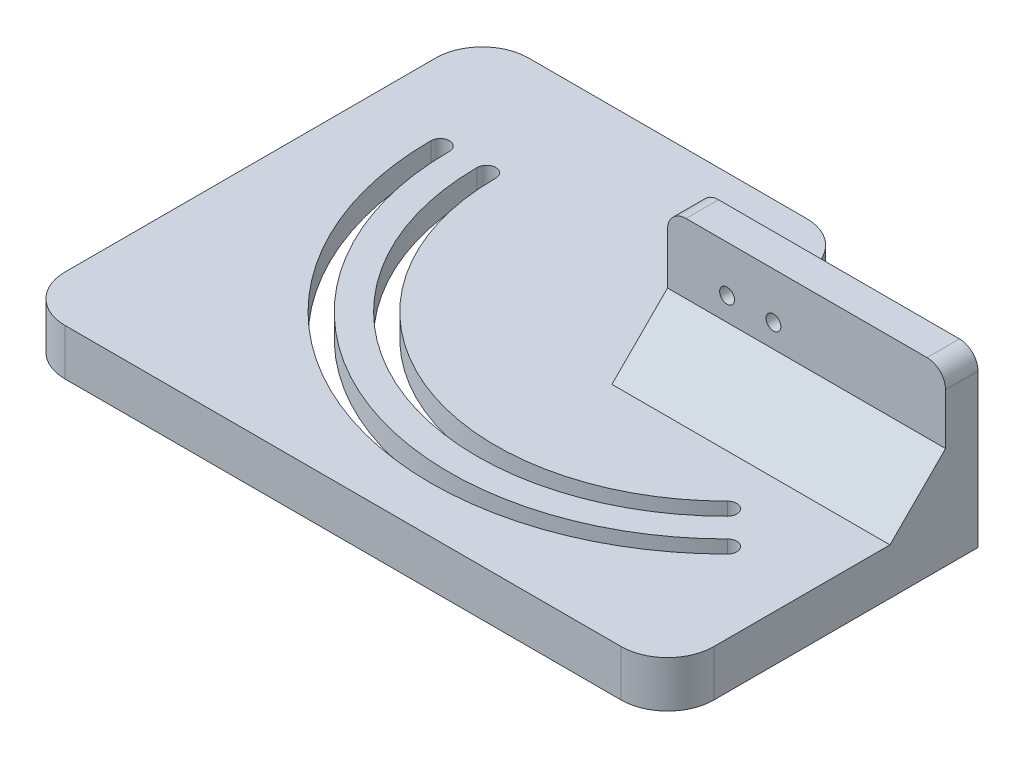
ISO-10303-21;
HEADER;
FILE_DESCRIPTION(('STEP AP214'),'2;1');
FILE_NAME('part.step','',(''),(''),'','','');
FILE_SCHEMA(('AUTOMOTIVE_DESIGN { 1 0 10303 214 1 1 1 1 }'));
ENDSEC;
DATA;
#1=APPLICATION_CONTEXT('core data for automotive mechanical design processes');
#2=APPLICATION_PROTOCOL_DEFINITION('international standard','automotive_design',2000,#1);
#3=PRODUCT_CONTEXT('',#1,'mechanical');
#4=PRODUCT('Part','Part','',(#3));
#5=PRODUCT_RELATED_PRODUCT_CATEGORY('part','',(#4));
#6=PRODUCT_DEFINITION_FORMATION('','',#4);
#7=PRODUCT_DEFINITION_CONTEXT('part definition',#1,'design');
#8=PRODUCT_DEFINITION('design','',#6,#7);
#9=PRODUCT_DEFINITION_SHAPE('','',#8);
#10=(LENGTH_UNIT() NAMED_UNIT(*) SI_UNIT(.MILLI.,.METRE.));
#11=(NAMED_UNIT(*) PLANE_ANGLE_UNIT() SI_UNIT($,.RADIAN.));
#12=(NAMED_UNIT(*) SI_UNIT($,.STERADIAN.) SOLID_ANGLE_UNIT());
#13=UNCERTAINTY_MEASURE_WITH_UNIT(LENGTH_MEASURE(1.E-05),#10,'distance_accuracy_value','');
#14=(GEOMETRIC_REPRESENTATION_CONTEXT(3) GLOBAL_UNCERTAINTY_ASSIGNED_CONTEXT((#13)) GLOBAL_UNIT_ASSIGNED_CONTEXT((#10,
#11,#12)) REPRESENTATION_CONTEXT('',''));
#15=CARTESIAN_POINT('',(0.,0.,0.));
#16=DIRECTION('',(0.,0.,1.));
#17=DIRECTION('',(1.,0.,0.));
#18=AXIS2_PLACEMENT_3D('',#15,#16,#17);
#19=CARTESIAN_POINT('',(0.,0.,0.));
#20=DIRECTION('',(0.,-1.,0.));
#21=DIRECTION('',(0.,0.,-1.));
#22=AXIS2_PLACEMENT_3D('',#19,#20,#21);
#23=PLANE('',#22);
#24=DIRECTION('',(-1.,0.,0.));
#25=VECTOR('',#24,1.);
#26=CARTESIAN_POINT('',(0.,0.,-120.));
#27=LINE('',#26,#25);
#28=CARTESIAN_POINT('',(100.,0.,-120.));
#29=VERTEX_POINT('',#28);
#30=CARTESIAN_POINT('',(40.,0.,-120.));
#31=VERTEX_POINT('',#30);
#32=EDGE_CURVE('E315',#29,#31,#27,.T.);
#33=ORIENTED_EDGE('',*,*,#32,.F.);
#34=CARTESIAN_POINT('',(100.,0.,-110.));
#35=DIRECTION('',(0.,-1.,0.));
#36=DIRECTION('',(0.,0.,-1.));
#37=AXIS2_PLACEMENT_3D('',#34,#35,#36);
#38=CIRCLE('',#37,10.);
#39=CARTESIAN_POINT('',(110.,0.,-110.));
#40=VERTEX_POINT('',#39);
#41=EDGE_CURVE('E85',#29,#40,#38,.T.);
#42=ORIENTED_EDGE('',*,*,#41,.T.);
#43=DIRECTION('',(0.,0.,-1.));
#44=VECTOR('',#43,1.);
#45=CARTESIAN_POINT('',(110.,0.,0.));
#46=LINE('',#45,#44);
#47=CARTESIAN_POINT('',(110.,0.,-97.));
#48=VERTEX_POINT('',#47);
#49=EDGE_CURVE('E428',#48,#40,#46,.T.);
#50=ORIENTED_EDGE('',*,*,#49,.F.);
#51=CARTESIAN_POINT('',(120.,0.,-97.));
#52=DIRECTION('',(0.,-1.,0.));
#53=DIRECTION('',(0.,0.,-1.));
#54=AXIS2_PLACEMENT_3D('',#51,#52,#53);
#55=CIRCLE('',#54,10.);
#56=CARTESIAN_POINT('',(120.,0.,-87.));
#57=VERTEX_POINT('',#56);
#58=EDGE_CURVE('E12',#48,#57,#55,.F.);
#59=ORIENTED_EDGE('',*,*,#58,.T.);
#60=DIRECTION('',(-1.,0.,0.));
#61=VECTOR('',#60,1.);
#62=CARTESIAN_POINT('',(0.,0.,-87.));
#63=LINE('',#62,#61);
#64=CARTESIAN_POINT('',(170.,0.,-87.));
#65=VERTEX_POINT('',#64);
#66=EDGE_CURVE('E427',#65,#57,#63,.T.);
#67=ORIENTED_EDGE('',*,*,#66,.F.);
#68=DIRECTION('',(0.,0.,-1.));
#69=VECTOR('',#68,1.);
#70=CARTESIAN_POINT('',(170.,0.,0.));
#71=LINE('',#70,#69);
#72=CARTESIAN_POINT('',(170.,0.,-30.));
#73=VERTEX_POINT('',#72);
#74=EDGE_CURVE('E310',#73,#65,#71,.T.);
#75=ORIENTED_EDGE('',*,*,#74,.F.);
#76=CARTESIAN_POINT('',(160.,0.,-30.));
#77=DIRECTION('',(0.,-1.,0.));
#78=DIRECTION('',(0.,0.,-1.));
#79=AXIS2_PLACEMENT_3D('',#76,#77,#78);
#80=CIRCLE('',#79,10.);
#81=CARTESIAN_POINT('',(160.,0.,-20.));
#82=VERTEX_POINT('',#81);
#83=EDGE_CURVE('E383',#73,#82,#80,.T.);
#84=ORIENTED_EDGE('',*,*,#83,.T.);
#85=DIRECTION('',(1.,0.,0.));
#86=VECTOR('',#85,1.);
#87=CARTESIAN_POINT('',(0.,0.,-20.));
#88=LINE('',#87,#86);
#89=CARTESIAN_POINT('',(40.,0.,-20.));
#90=VERTEX_POINT('',#89);
#91=EDGE_CURVE('E451',#90,#82,#88,.T.);
#92=ORIENTED_EDGE('',*,*,#91,.F.);
#93=CARTESIAN_POINT('',(40.,0.,-30.));
#94=DIRECTION('',(0.,-1.,0.));
#95=DIRECTION('',(0.,0.,-1.));
#96=AXIS2_PLACEMENT_3D('',#93,#94,#95);
#97=CIRCLE('',#96,10.);
#98=CARTESIAN_POINT('',(30.,0.,-30.));
#99=VERTEX_POINT('',#98);
#100=EDGE_CURVE('E386',#90,#99,#97,.T.);
#101=ORIENTED_EDGE('',*,*,#100,.T.);
#102=DIRECTION('',(0.,0.,1.));
#103=VECTOR('',#102,1.);
#104=CARTESIAN_POINT('',(30.,0.,0.));
#105=LINE('',#104,#103);
#106=CARTESIAN_POINT('',(30.,0.,-110.));
#107=VERTEX_POINT('',#106);
#108=EDGE_CURVE('E447',#107,#99,#105,.T.);
#109=ORIENTED_EDGE('',*,*,#108,.F.);
#110=CARTESIAN_POINT('',(40.,0.,-110.));
#111=DIRECTION('',(0.,-1.,0.));
#112=DIRECTION('',(0.,0.,-1.));
#113=AXIS2_PLACEMENT_3D('',#110,#111,#112);
#114=CIRCLE('',#113,10.);
#115=EDGE_CURVE('E379',#107,#31,#114,.T.);
#116=ORIENTED_EDGE('',*,*,#115,.T.);
#117=EDGE_LOOP('',(#33,#42,#50,#59,#67,#75,#84,#92,#101,#109,#116));
#118=FACE_BOUND('',#117,.T.);
#119=CARTESIAN_POINT('',(51.9348428694448,0.,-94.));
#120=DIRECTION('',(0.,-1.,0.));
#121=DIRECTION('',(0.,0.,-1.));
#122=AXIS2_PLACEMENT_3D('',#119,#120,#121);
#123=CIRCLE('',#122,12.);
#124=CARTESIAN_POINT('',(39.9348428694448,0.,-94.));
#125=VERTEX_POINT('',#124);
#126=CARTESIAN_POINT('',(63.9348428694448,0.,-93.9999999999993));
#127=VERTEX_POINT('',#126);
#128=EDGE_CURVE('E455',#125,#127,#123,.T.);
#129=ORIENTED_EDGE('',*,*,#128,.F.);
#130=CARTESIAN_POINT('',(108.934842869445,0.,-94.));
#131=DIRECTION('',(0.,-1.,0.));
#132=DIRECTION('',(0.,0.,-1.));
#133=AXIS2_PLACEMENT_3D('',#130,#131,#132);
#134=CIRCLE('',#133,69.);
#135=CARTESIAN_POINT('',(157.725210771317,0.,-45.2096320981288));
#136=VERTEX_POINT('',#135);
#137=EDGE_CURVE('E461',#136,#125,#134,.T.);
#138=ORIENTED_EDGE('',*,*,#137,.F.);
#139=CARTESIAN_POINT('',(149.239929397078,0.,-53.6949134723672));
#140=DIRECTION('',(0.,-1.,0.));
#141=DIRECTION('',(0.,0.,-1.));
#142=AXIS2_PLACEMENT_3D('',#139,#140,#141);
#143=CIRCLE('',#142,12.);
#144=CARTESIAN_POINT('',(140.75464802284,0.,-62.1801948466057));
#145=VERTEX_POINT('',#144);
#146=EDGE_CURVE('E480',#145,#136,#143,.T.);
#147=ORIENTED_EDGE('',*,*,#146,.F.);
#148=CARTESIAN_POINT('',(108.934842869445,0.,-94.));
#149=DIRECTION('',(0.,1.,0.));
#150=DIRECTION('',(0.,0.,-1.));
#151=AXIS2_PLACEMENT_3D('',#148,#149,#150);
#152=CIRCLE('',#151,45.);
#153=EDGE_CURVE('E476',#127,#145,#152,.T.);
#154=ORIENTED_EDGE('',*,*,#153,.F.);
#155=EDGE_LOOP('',(#129,#138,#147,#154));
#156=FACE_BOUND('',#155,.T.);
#157=ADVANCED_FACE('F69',(#118,#156),#23,.T.);
#158=CARTESIAN_POINT('',(56.9348428694448,-26.,-94.));
#159=DIRECTION('',(0.,1.,0.));
#160=DIRECTION('',(0.,0.,1.));
#161=AXIS2_PLACEMENT_3D('',#158,#159,#160);
#162=CYLINDRICAL_SURFACE('',#161,2.00000000000001);
#163=CARTESIAN_POINT('',(56.9348428694448,5.,-94.));
#164=DIRECTION('',(0.,-1.,0.));
#165=DIRECTION('',(0.,0.,-1.));
#166=AXIS2_PLACEMENT_3D('',#163,#164,#165);
#167=CIRCLE('',#166,2.00000000000001);
#168=CARTESIAN_POINT('',(58.9348428694448,5.,-94.));
#169=VERTEX_POINT('',#168);
#170=CARTESIAN_POINT('',(54.9348428694448,5.,-94.));
#171=VERTEX_POINT('',#170);
#172=EDGE_CURVE('E519',#169,#171,#167,.F.);
#173=ORIENTED_EDGE('',*,*,#172,.F.);
#174=DIRECTION('',(0.,1.,0.));
#175=VECTOR('',#174,1.);
#176=CARTESIAN_POINT('',(58.9348428694448,-26.,-94.));
#177=LINE('',#176,#175);
#178=CARTESIAN_POINT('',(58.9348428694448,10.,-94.));
#179=VERTEX_POINT('',#178);
#180=EDGE_CURVE('E567',#169,#179,#177,.T.);
#181=ORIENTED_EDGE('',*,*,#180,.T.);
#182=CARTESIAN_POINT('',(56.9348428694448,10.,-94.));
#183=DIRECTION('',(0.,1.,0.));
#184=DIRECTION('',(0.,0.,1.));
#185=AXIS2_PLACEMENT_3D('',#182,#183,#184);
#186=CIRCLE('',#185,2.00000000000001);
#187=CARTESIAN_POINT('',(54.9348428694448,10.,-94.));
#188=VERTEX_POINT('',#187);
#189=EDGE_CURVE('E550',#179,#188,#186,.T.);
#190=ORIENTED_EDGE('',*,*,#189,.T.);
#191=DIRECTION('',(0.,1.,0.));
#192=VECTOR('',#191,1.);
#193=CARTESIAN_POINT('',(54.9348428694448,-26.,-94.));
#194=LINE('',#193,#192);
#195=EDGE_CURVE('E566',#171,#188,#194,.T.);
#196=ORIENTED_EDGE('',*,*,#195,.F.);
#197=EDGE_LOOP('',(#173,#181,#190,#196));
#198=FACE_BOUND('',#197,.T.);
#199=ADVANCED_FACE('F607',(#198),#162,.F.);
#200=CARTESIAN_POINT('',(108.934842869445,-26.,-94.));
#201=DIRECTION('',(0.,1.,0.));
#202=DIRECTION('',(0.,0.,1.));
#203=AXIS2_PLACEMENT_3D('',#200,#201,#202);
#204=CYLINDRICAL_SURFACE('',#203,50.);
#205=ORIENTED_EDGE('',*,*,#180,.F.);
#206=CARTESIAN_POINT('',(108.934842869445,5.,-94.));
#207=DIRECTION('',(0.,-1.,0.));
#208=DIRECTION('',(0.,0.,-1.));
#209=AXIS2_PLACEMENT_3D('',#206,#207,#208);
#210=CIRCLE('',#209,50.);
#211=CARTESIAN_POINT('',(144.290181928773,5.,-58.644660940673));
#212=VERTEX_POINT('',#211);
#213=EDGE_CURVE('E515',#169,#212,#210,.F.);
#214=ORIENTED_EDGE('',*,*,#213,.T.);
#215=DIRECTION('',(0.,1.,0.));
#216=VECTOR('',#215,1.);
#217=CARTESIAN_POINT('',(144.290181928773,-26.,-58.644660940673));
#218=LINE('',#217,#216);
#219=CARTESIAN_POINT('',(144.290181928773,10.,-58.644660940673));
#220=VERTEX_POINT('',#219);
#221=EDGE_CURVE('E571',#212,#220,#218,.T.);
#222=ORIENTED_EDGE('',*,*,#221,.T.);
#223=CARTESIAN_POINT('',(108.934842869445,10.,-94.));
#224=DIRECTION('',(0.,1.,0.));
#225=DIRECTION('',(0.,0.,1.));
#226=AXIS2_PLACEMENT_3D('',#223,#224,#225);
#227=CIRCLE('',#226,50.);
#228=EDGE_CURVE('E562',#179,#220,#227,.T.);
#229=ORIENTED_EDGE('',*,*,#228,.F.);
#230=EDGE_LOOP('',(#205,#214,#222,#229));
#231=FACE_BOUND('',#230,.T.);
#232=ADVANCED_FACE('F612',(#231),#204,.T.);
#233=CARTESIAN_POINT('',(145.704395491146,-26.,-57.2304473782999));
#234=DIRECTION('',(0.,1.,0.));
#235=DIRECTION('',(0.,0.,1.));
#236=AXIS2_PLACEMENT_3D('',#233,#234,#235);
#237=CYLINDRICAL_SURFACE('',#236,2.00000000000001);
#238=CARTESIAN_POINT('',(145.704395491146,5.,-57.2304473782999));
#239=DIRECTION('',(0.,-1.,0.));
#240=DIRECTION('',(0.,0.,-1.));
#241=AXIS2_PLACEMENT_3D('',#238,#239,#240);
#242=CIRCLE('',#241,2.00000000000001);
#243=CARTESIAN_POINT('',(147.118609053519,5.,-55.8162338159269));
#244=VERTEX_POINT('',#243);
#245=EDGE_CURVE('E512',#244,#212,#242,.F.);
#246=ORIENTED_EDGE('',*,*,#245,.F.);
#247=DIRECTION('',(0.,1.,0.));
#248=VECTOR('',#247,1.);
#249=CARTESIAN_POINT('',(147.118609053519,-26.,-55.8162338159269));
#250=LINE('',#249,#248);
#251=CARTESIAN_POINT('',(147.118609053519,10.,-55.8162338159269));
#252=VERTEX_POINT('',#251);
#253=EDGE_CURVE('E574',#244,#252,#250,.T.);
#254=ORIENTED_EDGE('',*,*,#253,.T.);
#255=CARTESIAN_POINT('',(145.704395491146,10.,-57.2304473782999));
#256=DIRECTION('',(0.,1.,0.));
#257=DIRECTION('',(0.,0.,1.));
#258=AXIS2_PLACEMENT_3D('',#255,#256,#257);
#259=CIRCLE('',#258,2.00000000000001);
#260=EDGE_CURVE('E558',#252,#220,#259,.T.);
#261=ORIENTED_EDGE('',*,*,#260,.T.);
#262=ORIENTED_EDGE('',*,*,#221,.F.);
#263=EDGE_LOOP('',(#246,#254,#261,#262));
#264=FACE_BOUND('',#263,.T.);
#265=ADVANCED_FACE('F704',(#264),#237,.F.);
#266=CARTESIAN_POINT('',(108.934842869445,-26.,-94.));
#267=DIRECTION('',(0.,1.,0.));
#268=DIRECTION('',(0.,0.,1.));
#269=AXIS2_PLACEMENT_3D('',#266,#267,#268);
#270=CYLINDRICAL_SURFACE('',#269,54.);
#271=CARTESIAN_POINT('',(108.934842869445,5.,-94.));
#272=DIRECTION('',(0.,-1.,0.));
#273=DIRECTION('',(0.,0.,-1.));
#274=AXIS2_PLACEMENT_3D('',#271,#272,#273);
#275=CIRCLE('',#274,54.);
#276=EDGE_CURVE('E509',#171,#244,#275,.F.);
#277=ORIENTED_EDGE('',*,*,#276,.F.);
#278=ORIENTED_EDGE('',*,*,#195,.T.);
#279=CARTESIAN_POINT('',(108.934842869445,10.,-94.));
#280=DIRECTION('',(0.,1.,0.));
#281=DIRECTION('',(0.,0.,1.));
#282=AXIS2_PLACEMENT_3D('',#279,#280,#281);
#283=CIRCLE('',#282,54.);
#284=EDGE_CURVE('E554',#188,#252,#283,.T.);
#285=ORIENTED_EDGE('',*,*,#284,.T.);
#286=ORIENTED_EDGE('',*,*,#253,.F.);
#287=EDGE_LOOP('',(#277,#278,#285,#286));
#288=FACE_BOUND('',#287,.T.);
#289=ADVANCED_FACE('F689',(#288),#270,.F.);
#290=CARTESIAN_POINT('',(46.9348428694448,-26.,-94.));
#291=DIRECTION('',(0.,1.,0.));
#292=DIRECTION('',(0.,0.,1.));
#293=AXIS2_PLACEMENT_3D('',#290,#291,#292);
#294=CYLINDRICAL_SURFACE('',#293,2.00000000000001);
#295=CARTESIAN_POINT('',(46.9348428694448,5.,-94.));
#296=DIRECTION('',(0.,-1.,0.));
#297=DIRECTION('',(0.,0.,-1.));
#298=AXIS2_PLACEMENT_3D('',#295,#296,#297);
#299=CIRCLE('',#298,2.00000000000001);
#300=CARTESIAN_POINT('',(48.9348428694448,5.,-94.));
#301=VERTEX_POINT('',#300);
#302=CARTESIAN_POINT('',(44.9348428694448,5.,-94.));
#303=VERTEX_POINT('',#302);
#304=EDGE_CURVE('E506',#301,#303,#299,.F.);
#305=ORIENTED_EDGE('',*,*,#304,.F.);
#306=DIRECTION('',(0.,1.,0.));
#307=VECTOR('',#306,1.);
#308=CARTESIAN_POINT('',(48.9348428694448,-26.,-94.));
#309=LINE('',#308,#307);
#310=CARTESIAN_POINT('',(48.9348428694448,10.,-94.));
#311=VERTEX_POINT('',#310);
#312=EDGE_CURVE('E522',#301,#311,#309,.T.);
#313=ORIENTED_EDGE('',*,*,#312,.T.);
#314=CARTESIAN_POINT('',(46.9348428694448,10.,-94.));
#315=DIRECTION('',(0.,1.,0.));
#316=DIRECTION('',(0.,0.,1.));
#317=AXIS2_PLACEMENT_3D('',#314,#315,#316);
#318=CIRCLE('',#317,2.00000000000001);
#319=CARTESIAN_POINT('',(44.9348428694448,10.,-94.));
#320=VERTEX_POINT('',#319);
#321=EDGE_CURVE('E546',#311,#320,#318,.T.);
#322=ORIENTED_EDGE('',*,*,#321,.T.);
#323=DIRECTION('',(0.,1.,0.));
#324=VECTOR('',#323,1.);
#325=CARTESIAN_POINT('',(44.9348428694448,-26.,-94.));
#326=LINE('',#325,#324);
#327=EDGE_CURVE('E523',#303,#320,#326,.T.);
#328=ORIENTED_EDGE('',*,*,#327,.F.);
#329=EDGE_LOOP('',(#305,#313,#322,#328));
#330=FACE_BOUND('',#329,.T.);
#331=ADVANCED_FACE('F685',(#330),#294,.F.);
#332=CARTESIAN_POINT('',(108.934842869445,-26.,-94.));
#333=DIRECTION('',(0.,1.,0.));
#334=DIRECTION('',(0.,0.,1.));
#335=AXIS2_PLACEMENT_3D('',#332,#333,#334);
#336=CYLINDRICAL_SURFACE('',#335,60.);
#337=ORIENTED_EDGE('',*,*,#312,.F.);
#338=CARTESIAN_POINT('',(108.934842869445,5.,-94.));
#339=DIRECTION('',(0.,-1.,0.));
#340=DIRECTION('',(0.,0.,-1.));
#341=AXIS2_PLACEMENT_3D('',#338,#339,#340);
#342=CIRCLE('',#341,60.);
#343=CARTESIAN_POINT('',(151.361249740638,5.,-51.5735931288076));
#344=VERTEX_POINT('',#343);
#345=EDGE_CURVE('E502',#301,#344,#342,.F.);
#346=ORIENTED_EDGE('',*,*,#345,.T.);
#347=DIRECTION('',(0.,1.,0.));
#348=VECTOR('',#347,1.);
#349=CARTESIAN_POINT('',(151.361249740638,-26.,-51.5735931288076));
#350=LINE('',#349,#348);
#351=CARTESIAN_POINT('',(151.361249740638,10.,-51.5735931288076));
#352=VERTEX_POINT('',#351);
#353=EDGE_CURVE('E530',#344,#352,#350,.T.);
#354=ORIENTED_EDGE('',*,*,#353,.T.);
#355=CARTESIAN_POINT('',(108.934842869445,10.,-94.));
#356=DIRECTION('',(0.,1.,0.));
#357=DIRECTION('',(0.,0.,1.));
#358=AXIS2_PLACEMENT_3D('',#355,#356,#357);
#359=CIRCLE('',#358,60.);
#360=EDGE_CURVE('E526',#311,#352,#359,.T.);
#361=ORIENTED_EDGE('',*,*,#360,.F.);
#362=EDGE_LOOP('',(#337,#346,#354,#361));
#363=FACE_BOUND('',#362,.T.);
#364=ADVANCED_FACE('F688',(#363),#336,.T.);
#365=CARTESIAN_POINT('',(152.775463303011,-26.,-50.1593795664346));
#366=DIRECTION('',(0.,1.,0.));
#367=DIRECTION('',(0.,0.,1.));
#368=AXIS2_PLACEMENT_3D('',#365,#366,#367);
#369=CYLINDRICAL_SURFACE('',#368,2.00000000000002);
#370=CARTESIAN_POINT('',(152.775463303011,5.,-50.1593795664346));
#371=DIRECTION('',(0.,-1.,0.));
#372=DIRECTION('',(0.,0.,-1.));
#373=AXIS2_PLACEMENT_3D('',#370,#371,#372);
#374=CIRCLE('',#373,2.00000000000002);
#375=CARTESIAN_POINT('',(154.189676865384,5.,-48.7451660040615));
#376=VERTEX_POINT('',#375);
#377=EDGE_CURVE('E490',#376,#344,#374,.F.);
#378=ORIENTED_EDGE('',*,*,#377,.F.);
#379=DIRECTION('',(0.,1.,0.));
#380=VECTOR('',#379,1.);
#381=CARTESIAN_POINT('',(154.189676865384,-26.,-48.7451660040615));
#382=LINE('',#381,#380);
#383=CARTESIAN_POINT('',(154.189676865384,10.,-48.7451660040615));
#384=VERTEX_POINT('',#383);
#385=EDGE_CURVE('E527',#376,#384,#382,.T.);
#386=ORIENTED_EDGE('',*,*,#385,.T.);
#387=CARTESIAN_POINT('',(152.775463303011,10.,-50.1593795664346));
#388=DIRECTION('',(0.,1.,0.));
#389=DIRECTION('',(0.,0.,1.));
#390=AXIS2_PLACEMENT_3D('',#387,#388,#389);
#391=CIRCLE('',#390,2.00000000000002);
#392=EDGE_CURVE('E538',#384,#352,#391,.T.);
#393=ORIENTED_EDGE('',*,*,#392,.T.);
#394=ORIENTED_EDGE('',*,*,#353,.F.);
#395=EDGE_LOOP('',(#378,#386,#393,#394));
#396=FACE_BOUND('',#395,.T.);
#397=ADVANCED_FACE('F694',(#396),#369,.F.);
#398=CARTESIAN_POINT('',(108.934842869445,-26.,-94.));
#399=DIRECTION('',(0.,1.,0.));
#400=DIRECTION('',(0.,0.,1.));
#401=AXIS2_PLACEMENT_3D('',#398,#399,#400);
#402=CYLINDRICAL_SURFACE('',#401,64.);
#403=CARTESIAN_POINT('',(108.934842869445,5.,-94.));
#404=DIRECTION('',(0.,-1.,0.));
#405=DIRECTION('',(0.,0.,-1.));
#406=AXIS2_PLACEMENT_3D('',#403,#404,#405);
#407=CIRCLE('',#406,64.);
#408=EDGE_CURVE('E354',#303,#376,#407,.F.);
#409=ORIENTED_EDGE('',*,*,#408,.F.);
#410=ORIENTED_EDGE('',*,*,#327,.T.);
#411=CARTESIAN_POINT('',(108.934842869445,10.,-94.));
#412=DIRECTION('',(0.,1.,0.));
#413=DIRECTION('',(0.,0.,1.));
#414=AXIS2_PLACEMENT_3D('',#411,#412,#413);
#415=CIRCLE('',#414,64.);
#416=EDGE_CURVE('E542',#320,#384,#415,.T.);
#417=ORIENTED_EDGE('',*,*,#416,.T.);
#418=ORIENTED_EDGE('',*,*,#385,.F.);
#419=EDGE_LOOP('',(#409,#410,#417,#418));
#420=FACE_BOUND('',#419,.T.);
#421=ADVANCED_FACE('F691',(#420),#402,.F.);
#422=CARTESIAN_POINT('',(0.,10.,0.));
#423=DIRECTION('',(0.,-1.,0.));
#424=DIRECTION('',(0.,0.,-1.));
#425=AXIS2_PLACEMENT_3D('',#422,#423,#424);
#426=PLANE('',#425);
#427=ORIENTED_EDGE('',*,*,#416,.F.);
#428=ORIENTED_EDGE('',*,*,#321,.F.);
#429=ORIENTED_EDGE('',*,*,#360,.T.);
#430=ORIENTED_EDGE('',*,*,#392,.F.);
#431=EDGE_LOOP('',(#427,#428,#429,#430));
#432=FACE_BOUND('',#431,.T.);
#433=ORIENTED_EDGE('',*,*,#284,.F.);
#434=ORIENTED_EDGE('',*,*,#189,.F.);
#435=ORIENTED_EDGE('',*,*,#228,.T.);
#436=ORIENTED_EDGE('',*,*,#260,.F.);
#437=EDGE_LOOP('',(#433,#434,#435,#436));
#438=FACE_BOUND('',#437,.T.);
#439=DIRECTION('',(0.,0.,1.));
#440=VECTOR('',#439,1.);
#441=CARTESIAN_POINT('',(110.,10.,-80.));
#442=LINE('',#441,#440);
#443=CARTESIAN_POINT('',(110.,10.,-110.));
#444=VERTEX_POINT('',#443);
#445=CARTESIAN_POINT('',(110.,10.,-97.));
#446=VERTEX_POINT('',#445);
#447=EDGE_CURVE('E293',#444,#446,#442,.T.);
#448=ORIENTED_EDGE('',*,*,#447,.F.);
#449=CARTESIAN_POINT('',(100.,10.,-110.));
#450=DIRECTION('',(0.,-1.,0.));
#451=DIRECTION('',(0.,0.,-1.));
#452=AXIS2_PLACEMENT_3D('',#449,#450,#451);
#453=CIRCLE('',#452,10.);
#454=CARTESIAN_POINT('',(100.,10.,-120.));
#455=VERTEX_POINT('',#454);
#456=EDGE_CURVE('E93',#444,#455,#453,.F.);
#457=ORIENTED_EDGE('',*,*,#456,.T.);
#458=DIRECTION('',(-1.,0.,0.));
#459=VECTOR('',#458,1.);
#460=CARTESIAN_POINT('',(0.,10.,-120.));
#461=LINE('',#460,#459);
#462=CARTESIAN_POINT('',(40.,10.,-120.));
#463=VERTEX_POINT('',#462);
#464=EDGE_CURVE('E314',#455,#463,#461,.T.);
#465=ORIENTED_EDGE('',*,*,#464,.T.);
#466=CARTESIAN_POINT('',(40.,10.,-110.));
#467=DIRECTION('',(0.,-1.,0.));
#468=DIRECTION('',(0.,0.,-1.));
#469=AXIS2_PLACEMENT_3D('',#466,#467,#468);
#470=CIRCLE('',#469,10.);
#471=CARTESIAN_POINT('',(30.,10.,-110.));
#472=VERTEX_POINT('',#471);
#473=EDGE_CURVE('E364',#463,#472,#470,.F.);
#474=ORIENTED_EDGE('',*,*,#473,.T.);
#475=DIRECTION('',(0.,0.,-1.));
#476=VECTOR('',#475,1.);
#477=CARTESIAN_POINT('',(30.,10.,-20.));
#478=LINE('',#477,#476);
#479=CARTESIAN_POINT('',(30.,10.,-30.));
#480=VERTEX_POINT('',#479);
#481=EDGE_CURVE('E437',#480,#472,#478,.T.);
#482=ORIENTED_EDGE('',*,*,#481,.F.);
#483=CARTESIAN_POINT('',(40.,10.,-30.));
#484=DIRECTION('',(0.,-1.,0.));
#485=DIRECTION('',(0.,0.,-1.));
#486=AXIS2_PLACEMENT_3D('',#483,#484,#485);
#487=CIRCLE('',#486,10.);
#488=CARTESIAN_POINT('',(40.,10.,-20.));
#489=VERTEX_POINT('',#488);
#490=EDGE_CURVE('E370',#480,#489,#487,.F.);
#491=ORIENTED_EDGE('',*,*,#490,.T.);
#492=DIRECTION('',(-1.,0.,0.));
#493=VECTOR('',#492,1.);
#494=CARTESIAN_POINT('',(170.,10.,-20.));
#495=LINE('',#494,#493);
#496=CARTESIAN_POINT('',(160.,10.,-20.));
#497=VERTEX_POINT('',#496);
#498=EDGE_CURVE('E431',#497,#489,#495,.T.);
#499=ORIENTED_EDGE('',*,*,#498,.F.);
#500=CARTESIAN_POINT('',(160.,10.,-30.));
#501=DIRECTION('',(0.,-1.,0.));
#502=DIRECTION('',(0.,0.,-1.));
#503=AXIS2_PLACEMENT_3D('',#500,#501,#502);
#504=CIRCLE('',#503,10.);
#505=CARTESIAN_POINT('',(170.,10.,-30.));
#506=VERTEX_POINT('',#505);
#507=EDGE_CURVE('E367',#497,#506,#504,.F.);
#508=ORIENTED_EDGE('',*,*,#507,.T.);
#509=DIRECTION('',(0.,0.,-1.));
#510=VECTOR('',#509,1.);
#511=CARTESIAN_POINT('',(170.,10.,0.));
#512=LINE('',#511,#510);
#513=CARTESIAN_POINT('',(170.,10.,-68.));
#514=VERTEX_POINT('',#513);
#515=EDGE_CURVE('E311',#506,#514,#512,.T.);
#516=ORIENTED_EDGE('',*,*,#515,.T.);
#517=DIRECTION('',(-1.,0.,0.));
#518=VECTOR('',#517,1.);
#519=CARTESIAN_POINT('',(110.,10.,-68.));
#520=LINE('',#519,#518);
#521=CARTESIAN_POINT('',(110.,10.,-68.));
#522=VERTEX_POINT('',#521);
#523=EDGE_CURVE('E290',#514,#522,#520,.T.);
#524=ORIENTED_EDGE('',*,*,#523,.T.);
#525=CARTESIAN_POINT('',(110.,9.99999999999999,-87.));
#526=VERTEX_POINT('',#525);
#527=EDGE_CURVE('E279',#526,#522,#442,.T.);
#528=ORIENTED_EDGE('',*,*,#527,.F.);
#529=DIRECTION('',(-1.,0.,0.));
#530=VECTOR('',#529,1.);
#531=CARTESIAN_POINT('',(0.,10.,-87.));
#532=LINE('',#531,#530);
#533=CARTESIAN_POINT('',(120.,10.,-87.));
#534=VERTEX_POINT('',#533);
#535=EDGE_CURVE('E262',#534,#526,#532,.T.);
#536=ORIENTED_EDGE('',*,*,#535,.F.);
#537=CARTESIAN_POINT('',(120.,9.99999999999999,-97.));
#538=DIRECTION('',(0.,-1.,0.));
#539=DIRECTION('',(0.,0.,-1.));
#540=AXIS2_PLACEMENT_3D('',#537,#538,#539);
#541=CIRCLE('',#540,10.);
#542=EDGE_CURVE('E78',#534,#446,#541,.T.);
#543=ORIENTED_EDGE('',*,*,#542,.T.);
#544=EDGE_LOOP('',(#448,#457,#465,#474,#482,#491,#499,#508,#516,#524,#528,#536,#543));
#545=FACE_BOUND('',#544,.T.);
#546=ADVANCED_FACE('F288',(#432,#438,#545),#426,.F.);
#547=CARTESIAN_POINT('',(170.,10.,0.));
#548=DIRECTION('',(-1.,0.,0.));
#549=DIRECTION('',(0.,0.,1.));
#550=AXIS2_PLACEMENT_3D('',#547,#548,#549);
#551=PLANE('',#550);
#552=ORIENTED_EDGE('',*,*,#74,.T.);
#553=DIRECTION('',(0.,1.,0.));
#554=VECTOR('',#553,1.);
#555=CARTESIAN_POINT('',(170.,-54.,-87.));
#556=LINE('',#555,#554);
#557=CARTESIAN_POINT('',(170.,33.,-87.));
#558=VERTEX_POINT('',#557);
#559=EDGE_CURVE('E285',#65,#558,#556,.T.);
#560=ORIENTED_EDGE('',*,*,#559,.T.);
#561=DIRECTION('',(0.,0.,-1.));
#562=VECTOR('',#561,1.);
#563=CARTESIAN_POINT('',(170.,33.,0.));
#564=LINE('',#563,#562);
#565=CARTESIAN_POINT('',(170.,33.,-80.));
#566=VERTEX_POINT('',#565);
#567=EDGE_CURVE('E343',#558,#566,#564,.F.);
#568=ORIENTED_EDGE('',*,*,#567,.T.);
#569=DIRECTION('',(0.,-1.,0.));
#570=VECTOR('',#569,1.);
#571=CARTESIAN_POINT('',(170.,12.,-80.));
#572=LINE('',#571,#570);
#573=CARTESIAN_POINT('',(170.,22.0000000000001,-80.));
#574=VERTEX_POINT('',#573);
#575=EDGE_CURVE('E299',#566,#574,#572,.T.);
#576=ORIENTED_EDGE('',*,*,#575,.T.);
#577=DIRECTION('',(0.,0.707106781186551,-0.707106781186544));
#578=VECTOR('',#577,1.);
#579=CARTESIAN_POINT('',(170.,-24.,-34.0000000000003));
#580=LINE('',#579,#578);
#581=EDGE_CURVE('E329',#574,#514,#580,.F.);
#582=ORIENTED_EDGE('',*,*,#581,.T.);
#583=ORIENTED_EDGE('',*,*,#515,.F.);
#584=DIRECTION('',(0.,-1.,0.));
#585=VECTOR('',#584,1.);
#586=CARTESIAN_POINT('',(170.,10.,-30.));
#587=LINE('',#586,#585);
#588=EDGE_CURVE('E389',#506,#73,#587,.T.);
#589=ORIENTED_EDGE('',*,*,#588,.T.);
#590=EDGE_LOOP('',(#552,#560,#568,#576,#582,#583,#589));
#591=FACE_BOUND('',#590,.T.);
#592=ADVANCED_FACE('F620',(#591),#551,.F.);
#593=CARTESIAN_POINT('',(0.,10.,-120.));
#594=DIRECTION('',(0.,0.,1.));
#595=DIRECTION('',(1.,0.,0.));
#596=AXIS2_PLACEMENT_3D('',#593,#594,#595);
#597=PLANE('',#596);
#598=ORIENTED_EDGE('',*,*,#464,.F.);
#599=DIRECTION('',(0.,-1.,0.));
#600=VECTOR('',#599,1.);
#601=CARTESIAN_POINT('',(100.,10.,-120.));
#602=LINE('',#601,#600);
#603=EDGE_CURVE('E407',#455,#29,#602,.T.);
#604=ORIENTED_EDGE('',*,*,#603,.T.);
#605=ORIENTED_EDGE('',*,*,#32,.T.);
#606=DIRECTION('',(0.,1.,0.));
#607=VECTOR('',#606,1.);
#608=CARTESIAN_POINT('',(40.,10.,-120.));
#609=LINE('',#608,#607);
#610=EDGE_CURVE('E393',#31,#463,#609,.T.);
#611=ORIENTED_EDGE('',*,*,#610,.T.);
#612=EDGE_LOOP('',(#598,#604,#605,#611));
#613=FACE_BOUND('',#612,.T.);
#614=ADVANCED_FACE('F617',(#613),#597,.F.);
#615=CARTESIAN_POINT('',(110.,12.,-80.));
#616=DIRECTION('',(1.,0.,0.));
#617=DIRECTION('',(0.,0.,-1.));
#618=AXIS2_PLACEMENT_3D('',#615,#616,#617);
#619=PLANE('',#618);
#620=DIRECTION('',(0.,0.,1.));
#621=VECTOR('',#620,1.);
#622=CARTESIAN_POINT('',(110.,33.,-80.));
#623=LINE('',#622,#621);
#624=CARTESIAN_POINT('',(110.,33.,-80.));
#625=VERTEX_POINT('',#624);
#626=CARTESIAN_POINT('',(110.,33.,-87.));
#627=VERTEX_POINT('',#626);
#628=EDGE_CURVE('E283',#625,#627,#623,.F.);
#629=ORIENTED_EDGE('',*,*,#628,.T.);
#630=DIRECTION('',(0.,1.,0.));
#631=VECTOR('',#630,1.);
#632=CARTESIAN_POINT('',(110.,-54.,-87.));
#633=LINE('',#632,#631);
#634=EDGE_CURVE('E267',#526,#627,#633,.T.);
#635=ORIENTED_EDGE('',*,*,#634,.F.);
#636=ORIENTED_EDGE('',*,*,#527,.T.);
#637=DIRECTION('',(0.,-0.707106781186551,0.707106781186544));
#638=VECTOR('',#637,1.);
#639=CARTESIAN_POINT('',(110.,17.,-74.9999999999999));
#640=LINE('',#639,#638);
#641=CARTESIAN_POINT('',(110.,22.0000000000001,-80.));
#642=VERTEX_POINT('',#641);
#643=EDGE_CURVE('E333',#522,#642,#640,.F.);
#644=ORIENTED_EDGE('',*,*,#643,.T.);
#645=DIRECTION('',(0.,-1.,0.));
#646=VECTOR('',#645,1.);
#647=CARTESIAN_POINT('',(110.,12.,-80.));
#648=LINE('',#647,#646);
#649=EDGE_CURVE('E307',#625,#642,#648,.T.);
#650=ORIENTED_EDGE('',*,*,#649,.F.);
#651=EDGE_LOOP('',(#629,#635,#636,#644,#650));
#652=FACE_BOUND('',#651,.T.);
#653=ADVANCED_FACE('F277',(#652),#619,.F.);
#654=CARTESIAN_POINT('',(170.,12.,-80.));
#655=DIRECTION('',(0.,0.,-1.));
#656=DIRECTION('',(-1.,0.,0.));
#657=AXIS2_PLACEMENT_3D('',#654,#655,#656);
#658=PLANE('',#657);
#659=CARTESIAN_POINT('',(132.854949503101,27.,-80.));
#660=DIRECTION('',(0.,0.,-1.));
#661=DIRECTION('',(-1.,0.,0.));
#662=AXIS2_PLACEMENT_3D('',#659,#660,#661);
#663=CIRCLE('',#662,1.59999999998876);
#664=CARTESIAN_POINT('',(131.254949503112,27.,-80.));
#665=VERTEX_POINT('',#664);
#666=EDGE_CURVE('E301',#665,#665,#663,.T.);
#667=ORIENTED_EDGE('',*,*,#666,.T.);
#668=EDGE_LOOP('',(#667));
#669=FACE_BOUND('',#668,.T.);
#670=CARTESIAN_POINT('',(122.854949503101,27.,-80.));
#671=DIRECTION('',(0.,0.,-1.));
#672=DIRECTION('',(-1.,0.,0.));
#673=AXIS2_PLACEMENT_3D('',#670,#671,#672);
#674=CIRCLE('',#673,1.6);
#675=CARTESIAN_POINT('',(121.254949503101,27.,-80.));
#676=VERTEX_POINT('',#675);
#677=EDGE_CURVE('E570',#676,#676,#674,.T.);
#678=ORIENTED_EDGE('',*,*,#677,.T.);
#679=EDGE_LOOP('',(#678));
#680=FACE_BOUND('',#679,.T.);
#681=ORIENTED_EDGE('',*,*,#575,.F.);
#682=CARTESIAN_POINT('',(166.,33.,-80.));
#683=DIRECTION('',(0.,0.,-1.));
#684=DIRECTION('',(-1.,0.,0.));
#685=AXIS2_PLACEMENT_3D('',#682,#683,#684);
#686=CIRCLE('',#685,4.);
#687=CARTESIAN_POINT('',(166.,37.,-80.));
#688=VERTEX_POINT('',#687);
#689=EDGE_CURVE('E349',#566,#688,#686,.F.);
#690=ORIENTED_EDGE('',*,*,#689,.T.);
#691=DIRECTION('',(1.,0.,0.));
#692=VECTOR('',#691,1.);
#693=CARTESIAN_POINT('',(170.,37.,-80.));
#694=LINE('',#693,#692);
#695=CARTESIAN_POINT('',(114.,37.,-80.));
#696=VERTEX_POINT('',#695);
#697=EDGE_CURVE('E294',#696,#688,#694,.T.);
#698=ORIENTED_EDGE('',*,*,#697,.F.);
#699=CARTESIAN_POINT('',(114.,33.,-80.));
#700=DIRECTION('',(0.,0.,-1.));
#701=DIRECTION('',(-1.,0.,0.));
#702=AXIS2_PLACEMENT_3D('',#699,#700,#701);
#703=CIRCLE('',#702,4.);
#704=EDGE_CURVE('E346',#696,#625,#703,.F.);
#705=ORIENTED_EDGE('',*,*,#704,.T.);
#706=ORIENTED_EDGE('',*,*,#649,.T.);
#707=DIRECTION('',(1.,0.,0.));
#708=VECTOR('',#707,1.);
#709=CARTESIAN_POINT('',(170.,22.0000000000001,-80.));
#710=LINE('',#709,#708);
#711=EDGE_CURVE('E318',#642,#574,#710,.T.);
#712=ORIENTED_EDGE('',*,*,#711,.T.);
#713=EDGE_LOOP('',(#681,#690,#698,#705,#706,#712));
#714=FACE_BOUND('',#713,.T.);
#715=ADVANCED_FACE('F585',(#669,#680,#714),#658,.F.);
#716=CARTESIAN_POINT('',(0.,37.,0.));
#717=DIRECTION('',(0.,-1.,0.));
#718=DIRECTION('',(0.,0.,-1.));
#719=AXIS2_PLACEMENT_3D('',#716,#717,#718);
#720=PLANE('',#719);
#721=DIRECTION('',(0.,0.,-1.));
#722=VECTOR('',#721,1.);
#723=CARTESIAN_POINT('',(166.,37.,0.));
#724=LINE('',#723,#722);
#725=CARTESIAN_POINT('',(166.,37.,-87.));
#726=VERTEX_POINT('',#725);
#727=EDGE_CURVE('E339',#688,#726,#724,.T.);
#728=ORIENTED_EDGE('',*,*,#727,.T.);
#729=DIRECTION('',(1.,0.,0.));
#730=VECTOR('',#729,1.);
#731=CARTESIAN_POINT('',(170.,37.,-87.));
#732=LINE('',#731,#730);
#733=CARTESIAN_POINT('',(114.,37.,-87.));
#734=VERTEX_POINT('',#733);
#735=EDGE_CURVE('E286',#734,#726,#732,.T.);
#736=ORIENTED_EDGE('',*,*,#735,.F.);
#737=DIRECTION('',(0.,0.,1.));
#738=VECTOR('',#737,1.);
#739=CARTESIAN_POINT('',(114.,37.,0.));
#740=LINE('',#739,#738);
#741=EDGE_CURVE('E336',#734,#696,#740,.T.);
#742=ORIENTED_EDGE('',*,*,#741,.T.);
#743=ORIENTED_EDGE('',*,*,#697,.T.);
#744=EDGE_LOOP('',(#728,#736,#742,#743));
#745=FACE_BOUND('',#744,.T.);
#746=ADVANCED_FACE('F601',(#745),#720,.F.);
#747=CARTESIAN_POINT('',(122.854949503101,27.,-78.));
#748=DIRECTION('',(0.,0.,-1.));
#749=DIRECTION('',(-1.,0.,0.));
#750=AXIS2_PLACEMENT_3D('',#747,#748,#749);
#751=CYLINDRICAL_SURFACE('',#750,1.6);
#752=CARTESIAN_POINT('',(122.854949503101,27.,-87.));
#753=DIRECTION('',(0.,0.,1.));
#754=DIRECTION('',(1.,0.,0.));
#755=AXIS2_PLACEMENT_3D('',#752,#753,#754);
#756=CIRCLE('',#755,1.6);
#757=CARTESIAN_POINT('',(124.454949503101,27.,-87.));
#758=VERTEX_POINT('',#757);
#759=EDGE_CURVE('E432',#758,#758,#756,.F.);
#760=ORIENTED_EDGE('',*,*,#759,.T.);
#761=EDGE_LOOP('',(#760));
#762=FACE_BOUND('',#761,.T.);
#763=ORIENTED_EDGE('',*,*,#677,.F.);
#764=EDGE_LOOP('',(#763));
#765=FACE_BOUND('',#764,.T.);
#766=ADVANCED_FACE('F591',(#762,#765),#751,.F.);
#767=CARTESIAN_POINT('',(132.854949503101,27.,-78.));
#768=DIRECTION('',(0.,0.,-1.));
#769=DIRECTION('',(-1.,0.,0.));
#770=AXIS2_PLACEMENT_3D('',#767,#768,#769);
#771=CYLINDRICAL_SURFACE('',#770,1.59999999998876);
#772=CARTESIAN_POINT('',(132.854949503101,27.,-87.));
#773=DIRECTION('',(0.,0.,1.));
#774=DIRECTION('',(1.,0.,0.));
#775=AXIS2_PLACEMENT_3D('',#772,#773,#774);
#776=CIRCLE('',#775,1.59999999998876);
#777=CARTESIAN_POINT('',(134.45494950309,27.,-87.));
#778=VERTEX_POINT('',#777);
#779=EDGE_CURVE('E440',#778,#778,#776,.F.);
#780=ORIENTED_EDGE('',*,*,#779,.T.);
#781=EDGE_LOOP('',(#780));
#782=FACE_BOUND('',#781,.T.);
#783=ORIENTED_EDGE('',*,*,#666,.F.);
#784=EDGE_LOOP('',(#783));
#785=FACE_BOUND('',#784,.T.);
#786=ADVANCED_FACE('F588',(#782,#785),#771,.F.);
#787=CARTESIAN_POINT('',(170.,22.0000000000001,-80.));
#788=DIRECTION('',(0.,0.707106781186544,0.707106781186551));
#789=DIRECTION('',(-1.,0.,0.));
#790=AXIS2_PLACEMENT_3D('',#787,#788,#789);
#791=PLANE('',#790);
#792=ORIENTED_EDGE('',*,*,#643,.F.);
#793=ORIENTED_EDGE('',*,*,#523,.F.);
#794=ORIENTED_EDGE('',*,*,#581,.F.);
#795=ORIENTED_EDGE('',*,*,#711,.F.);
#796=EDGE_LOOP('',(#792,#793,#794,#795));
#797=FACE_BOUND('',#796,.T.);
#798=ADVANCED_FACE('F590',(#797),#791,.T.);
#799=CARTESIAN_POINT('',(166.,33.,0.));
#800=DIRECTION('',(0.,0.,-1.));
#801=DIRECTION('',(-1.,0.,0.));
#802=AXIS2_PLACEMENT_3D('',#799,#800,#801);
#803=CYLINDRICAL_SURFACE('',#802,4.);
#804=CARTESIAN_POINT('',(166.,33.,-87.));
#805=DIRECTION('',(0.,0.,1.));
#806=DIRECTION('',(1.,0.,0.));
#807=AXIS2_PLACEMENT_3D('',#804,#805,#806);
#808=CIRCLE('',#807,4.);
#809=EDGE_CURVE('E1038',#726,#558,#808,.F.);
#810=ORIENTED_EDGE('',*,*,#809,.F.);
#811=ORIENTED_EDGE('',*,*,#727,.F.);
#812=ORIENTED_EDGE('',*,*,#689,.F.);
#813=ORIENTED_EDGE('',*,*,#567,.F.);
#814=EDGE_LOOP('',(#810,#811,#812,#813));
#815=FACE_BOUND('',#814,.T.);
#816=ADVANCED_FACE('F598',(#815),#803,.T.);
#817=CARTESIAN_POINT('',(114.,33.,0.));
#818=DIRECTION('',(0.,0.,1.));
#819=DIRECTION('',(1.,0.,0.));
#820=AXIS2_PLACEMENT_3D('',#817,#818,#819);
#821=CYLINDRICAL_SURFACE('',#820,4.);
#822=CARTESIAN_POINT('',(114.,33.,-87.));
#823=DIRECTION('',(0.,0.,1.));
#824=DIRECTION('',(1.,0.,0.));
#825=AXIS2_PLACEMENT_3D('',#822,#823,#824);
#826=CIRCLE('',#825,4.);
#827=EDGE_CURVE('E273',#627,#734,#826,.F.);
#828=ORIENTED_EDGE('',*,*,#827,.F.);
#829=ORIENTED_EDGE('',*,*,#628,.F.);
#830=ORIENTED_EDGE('',*,*,#704,.F.);
#831=ORIENTED_EDGE('',*,*,#741,.F.);
#832=EDGE_LOOP('',(#828,#829,#830,#831));
#833=FACE_BOUND('',#832,.T.);
#834=ADVANCED_FACE('F630',(#833),#821,.T.);
#835=CARTESIAN_POINT('',(80.4348428694448,5.,-94.));
#836=DIRECTION('',(0.,-1.,0.));
#837=DIRECTION('',(0.,0.,-1.));
#838=AXIS2_PLACEMENT_3D('',#835,#836,#837);
#839=PLANE('',#838);
#840=ORIENTED_EDGE('',*,*,#304,.T.);
#841=ORIENTED_EDGE('',*,*,#408,.T.);
#842=ORIENTED_EDGE('',*,*,#377,.T.);
#843=ORIENTED_EDGE('',*,*,#345,.F.);
#844=EDGE_LOOP('',(#840,#841,#842,#843));
#845=FACE_BOUND('',#844,.T.);
#846=CARTESIAN_POINT('',(51.9348428694448,5.,-94.));
#847=DIRECTION('',(0.,-1.,0.));
#848=DIRECTION('',(0.,0.,-1.));
#849=AXIS2_PLACEMENT_3D('',#846,#847,#848);
#850=CIRCLE('',#849,12.);
#851=CARTESIAN_POINT('',(39.9348428694448,5.,-94.));
#852=VERTEX_POINT('',#851);
#853=CARTESIAN_POINT('',(63.9348428694448,5.,-93.9999999999993));
#854=VERTEX_POINT('',#853);
#855=EDGE_CURVE('E456',#852,#854,#850,.T.);
#856=ORIENTED_EDGE('',*,*,#855,.T.);
#857=CARTESIAN_POINT('',(108.934842869445,5.,-94.));
#858=DIRECTION('',(0.,1.,0.));
#859=DIRECTION('',(0.,0.,-1.));
#860=AXIS2_PLACEMENT_3D('',#857,#858,#859);
#861=CIRCLE('',#860,45.);
#862=CARTESIAN_POINT('',(140.75464802284,5.,-62.1801948466057));
#863=VERTEX_POINT('',#862);
#864=EDGE_CURVE('E460',#854,#863,#861,.T.);
#865=ORIENTED_EDGE('',*,*,#864,.T.);
#866=CARTESIAN_POINT('',(149.239929397078,5.,-53.6949134723672));
#867=DIRECTION('',(0.,-1.,0.));
#868=DIRECTION('',(0.,0.,-1.));
#869=AXIS2_PLACEMENT_3D('',#866,#867,#868);
#870=CIRCLE('',#869,12.);
#871=CARTESIAN_POINT('',(157.725210771317,5.,-45.2096320981288));
#872=VERTEX_POINT('',#871);
#873=EDGE_CURVE('E465',#863,#872,#870,.T.);
#874=ORIENTED_EDGE('',*,*,#873,.T.);
#875=CARTESIAN_POINT('',(108.934842869445,5.,-94.));
#876=DIRECTION('',(0.,-1.,0.));
#877=DIRECTION('',(0.,0.,-1.));
#878=AXIS2_PLACEMENT_3D('',#875,#876,#877);
#879=CIRCLE('',#878,69.);
#880=EDGE_CURVE('E469',#872,#852,#879,.T.);
#881=ORIENTED_EDGE('',*,*,#880,.T.);
#882=EDGE_LOOP('',(#856,#865,#874,#881));
#883=FACE_BOUND('',#882,.T.);
#884=ORIENTED_EDGE('',*,*,#172,.T.);
#885=ORIENTED_EDGE('',*,*,#276,.T.);
#886=ORIENTED_EDGE('',*,*,#245,.T.);
#887=ORIENTED_EDGE('',*,*,#213,.F.);
#888=EDGE_LOOP('',(#884,#885,#886,#887));
#889=FACE_BOUND('',#888,.T.);
#890=ADVANCED_FACE('F634',(#845,#883,#889),#839,.T.);
#891=CARTESIAN_POINT('',(51.9348428694448,5.,-94.));
#892=DIRECTION('',(0.,-1.,0.));
#893=DIRECTION('',(0.,0.,-1.));
#894=AXIS2_PLACEMENT_3D('',#891,#892,#893);
#895=CYLINDRICAL_SURFACE('',#894,12.);
#896=ORIENTED_EDGE('',*,*,#128,.T.);
#897=DIRECTION('',(0.,-1.,0.));
#898=VECTOR('',#897,1.);
#899=CARTESIAN_POINT('',(63.9348428694448,5.,-93.9999999999993));
#900=LINE('',#899,#898);
#901=EDGE_CURVE('E473',#854,#127,#900,.T.);
#902=ORIENTED_EDGE('',*,*,#901,.F.);
#903=ORIENTED_EDGE('',*,*,#855,.F.);
#904=DIRECTION('',(0.,-1.,0.));
#905=VECTOR('',#904,1.);
#906=CARTESIAN_POINT('',(39.9348428694448,5.,-94.));
#907=LINE('',#906,#905);
#908=EDGE_CURVE('E487',#852,#125,#907,.T.);
#909=ORIENTED_EDGE('',*,*,#908,.T.);
#910=EDGE_LOOP('',(#896,#902,#903,#909));
#911=FACE_BOUND('',#910,.T.);
#912=ADVANCED_FACE('F669',(#911),#895,.F.);
#913=CARTESIAN_POINT('',(108.934842869445,5.,-94.));
#914=DIRECTION('',(0.,-1.,0.));
#915=DIRECTION('',(0.,0.,-1.));
#916=AXIS2_PLACEMENT_3D('',#913,#914,#915);
#917=CYLINDRICAL_SURFACE('',#916,69.);
#918=ORIENTED_EDGE('',*,*,#137,.T.);
#919=ORIENTED_EDGE('',*,*,#908,.F.);
#920=ORIENTED_EDGE('',*,*,#880,.F.);
#921=DIRECTION('',(0.,-1.,0.));
#922=VECTOR('',#921,1.);
#923=CARTESIAN_POINT('',(157.725210771317,5.,-45.2096320981288));
#924=LINE('',#923,#922);
#925=EDGE_CURVE('E491',#872,#136,#924,.T.);
#926=ORIENTED_EDGE('',*,*,#925,.T.);
#927=EDGE_LOOP('',(#918,#919,#920,#926));
#928=FACE_BOUND('',#927,.T.);
#929=ADVANCED_FACE('F671',(#928),#917,.F.);
#930=CARTESIAN_POINT('',(149.239929397078,5.,-53.6949134723672));
#931=DIRECTION('',(0.,-1.,0.));
#932=DIRECTION('',(0.,0.,-1.));
#933=AXIS2_PLACEMENT_3D('',#930,#931,#932);
#934=CYLINDRICAL_SURFACE('',#933,12.);
#935=ORIENTED_EDGE('',*,*,#146,.T.);
#936=ORIENTED_EDGE('',*,*,#925,.F.);
#937=ORIENTED_EDGE('',*,*,#873,.F.);
#938=DIRECTION('',(0.,-1.,0.));
#939=VECTOR('',#938,1.);
#940=CARTESIAN_POINT('',(140.75464802284,5.,-62.1801948466057));
#941=LINE('',#940,#939);
#942=EDGE_CURVE('E494',#863,#145,#941,.T.);
#943=ORIENTED_EDGE('',*,*,#942,.T.);
#944=EDGE_LOOP('',(#935,#936,#937,#943));
#945=FACE_BOUND('',#944,.T.);
#946=ADVANCED_FACE('F674',(#945),#934,.F.);
#947=CARTESIAN_POINT('',(108.934842869445,5.,-94.));
#948=DIRECTION('',(0.,-1.,0.));
#949=DIRECTION('',(0.,0.,-1.));
#950=AXIS2_PLACEMENT_3D('',#947,#948,#949);
#951=CYLINDRICAL_SURFACE('',#950,45.);
#952=ORIENTED_EDGE('',*,*,#153,.T.);
#953=ORIENTED_EDGE('',*,*,#942,.F.);
#954=ORIENTED_EDGE('',*,*,#864,.F.);
#955=ORIENTED_EDGE('',*,*,#901,.T.);
#956=EDGE_LOOP('',(#952,#953,#954,#955));
#957=FACE_BOUND('',#956,.T.);
#958=ADVANCED_FACE('F662',(#957),#951,.T.);
#959=CARTESIAN_POINT('',(30.,-9.,-20.));
#960=DIRECTION('',(1.,0.,0.));
#961=DIRECTION('',(0.,0.,-1.));
#962=AXIS2_PLACEMENT_3D('',#959,#960,#961);
#963=PLANE('',#962);
#964=ORIENTED_EDGE('',*,*,#108,.T.);
#965=DIRECTION('',(0.,1.,0.));
#966=VECTOR('',#965,1.);
#967=CARTESIAN_POINT('',(30.,-9.,-30.));
#968=LINE('',#967,#966);
#969=EDGE_CURVE('E360',#99,#480,#968,.T.);
#970=ORIENTED_EDGE('',*,*,#969,.T.);
#971=ORIENTED_EDGE('',*,*,#481,.T.);
#972=DIRECTION('',(0.,1.,0.));
#973=VECTOR('',#972,1.);
#974=CARTESIAN_POINT('',(30.,-9.,-110.));
#975=LINE('',#974,#973);
#976=EDGE_CURVE('E357',#472,#107,#975,.F.);
#977=ORIENTED_EDGE('',*,*,#976,.T.);
#978=EDGE_LOOP('',(#964,#970,#971,#977));
#979=FACE_BOUND('',#978,.T.);
#980=ADVANCED_FACE('F659',(#979),#963,.F.);
#981=CARTESIAN_POINT('',(170.,-9.,-20.));
#982=DIRECTION('',(0.,0.,-1.));
#983=DIRECTION('',(-1.,0.,0.));
#984=AXIS2_PLACEMENT_3D('',#981,#982,#983);
#985=PLANE('',#984);
#986=ORIENTED_EDGE('',*,*,#498,.T.);
#987=DIRECTION('',(0.,1.,0.));
#988=VECTOR('',#987,1.);
#989=CARTESIAN_POINT('',(40.,-9.,-20.));
#990=LINE('',#989,#988);
#991=EDGE_CURVE('E376',#489,#90,#990,.F.);
#992=ORIENTED_EDGE('',*,*,#991,.T.);
#993=ORIENTED_EDGE('',*,*,#91,.T.);
#994=DIRECTION('',(0.,-1.,0.));
#995=VECTOR('',#994,1.);
#996=CARTESIAN_POINT('',(160.,-9.,-20.));
#997=LINE('',#996,#995);
#998=EDGE_CURVE('E373',#82,#497,#997,.F.);
#999=ORIENTED_EDGE('',*,*,#998,.T.);
#1000=EDGE_LOOP('',(#986,#992,#993,#999));
#1001=FACE_BOUND('',#1000,.T.);
#1002=ADVANCED_FACE('F640',(#1001),#985,.F.);
#1003=CARTESIAN_POINT('',(40.,-9.,-30.));
#1004=DIRECTION('',(0.,1.,0.));
#1005=DIRECTION('',(0.,0.,1.));
#1006=AXIS2_PLACEMENT_3D('',#1003,#1004,#1005);
#1007=CYLINDRICAL_SURFACE('',#1006,10.);
#1008=ORIENTED_EDGE('',*,*,#100,.F.);
#1009=ORIENTED_EDGE('',*,*,#991,.F.);
#1010=ORIENTED_EDGE('',*,*,#490,.F.);
#1011=ORIENTED_EDGE('',*,*,#969,.F.);
#1012=EDGE_LOOP('',(#1008,#1009,#1010,#1011));
#1013=FACE_BOUND('',#1012,.T.);
#1014=ADVANCED_FACE('F636',(#1013),#1007,.T.);
#1015=CARTESIAN_POINT('',(160.,10.,-30.));
#1016=DIRECTION('',(0.,-1.,0.));
#1017=DIRECTION('',(0.,0.,-1.));
#1018=AXIS2_PLACEMENT_3D('',#1015,#1016,#1017);
#1019=CYLINDRICAL_SURFACE('',#1018,10.);
#1020=ORIENTED_EDGE('',*,*,#507,.F.);
#1021=ORIENTED_EDGE('',*,*,#998,.F.);
#1022=ORIENTED_EDGE('',*,*,#83,.F.);
#1023=ORIENTED_EDGE('',*,*,#588,.F.);
#1024=EDGE_LOOP('',(#1020,#1021,#1022,#1023));
#1025=FACE_BOUND('',#1024,.T.);
#1026=ADVANCED_FACE('F639',(#1025),#1019,.T.);
#1027=CARTESIAN_POINT('',(40.,10.,-110.));
#1028=DIRECTION('',(0.,1.,0.));
#1029=DIRECTION('',(0.,0.,1.));
#1030=AXIS2_PLACEMENT_3D('',#1027,#1028,#1029);
#1031=CYLINDRICAL_SURFACE('',#1030,10.);
#1032=ORIENTED_EDGE('',*,*,#115,.F.);
#1033=ORIENTED_EDGE('',*,*,#976,.F.);
#1034=ORIENTED_EDGE('',*,*,#473,.F.);
#1035=ORIENTED_EDGE('',*,*,#610,.F.);
#1036=EDGE_LOOP('',(#1032,#1033,#1034,#1035));
#1037=FACE_BOUND('',#1036,.T.);
#1038=ADVANCED_FACE('F644',(#1037),#1031,.T.);
#1039=CARTESIAN_POINT('',(170.,-54.,-87.));
#1040=DIRECTION('',(0.,0.,1.));
#1041=DIRECTION('',(1.,0.,0.));
#1042=AXIS2_PLACEMENT_3D('',#1039,#1040,#1041);
#1043=PLANE('',#1042);
#1044=ORIENTED_EDGE('',*,*,#66,.T.);
#1045=DIRECTION('',(0.,1.,0.));
#1046=VECTOR('',#1045,1.);
#1047=CARTESIAN_POINT('',(120.,9.99999999999999,-87.));
#1048=LINE('',#1047,#1046);
#1049=EDGE_CURVE('E270',#57,#534,#1048,.T.);
#1050=ORIENTED_EDGE('',*,*,#1049,.T.);
#1051=ORIENTED_EDGE('',*,*,#535,.T.);
#1052=ORIENTED_EDGE('',*,*,#634,.T.);
#1053=ORIENTED_EDGE('',*,*,#827,.T.);
#1054=ORIENTED_EDGE('',*,*,#735,.T.);
#1055=ORIENTED_EDGE('',*,*,#809,.T.);
#1056=ORIENTED_EDGE('',*,*,#559,.F.);
#1057=EDGE_LOOP('',(#1044,#1050,#1051,#1052,#1053,#1054,#1055,#1056));
#1058=FACE_BOUND('',#1057,.T.);
#1059=ORIENTED_EDGE('',*,*,#779,.F.);
#1060=EDGE_LOOP('',(#1059));
#1061=FACE_BOUND('',#1060,.T.);
#1062=ORIENTED_EDGE('',*,*,#759,.F.);
#1063=EDGE_LOOP('',(#1062));
#1064=FACE_BOUND('',#1063,.T.);
#1065=ADVANCED_FACE('F265',(#1058,#1061,#1064),#1043,.F.);
#1066=CARTESIAN_POINT('',(110.,-54.,-87.));
#1067=DIRECTION('',(-1.,0.,0.));
#1068=DIRECTION('',(0.,0.,1.));
#1069=AXIS2_PLACEMENT_3D('',#1066,#1067,#1068);
#1070=PLANE('',#1069);
#1071=ORIENTED_EDGE('',*,*,#447,.T.);
#1072=DIRECTION('',(0.,1.,0.));
#1073=VECTOR('',#1072,1.);
#1074=CARTESIAN_POINT('',(110.,0.,-97.));
#1075=LINE('',#1074,#1073);
#1076=EDGE_CURVE('E404',#446,#48,#1075,.F.);
#1077=ORIENTED_EDGE('',*,*,#1076,.T.);
#1078=ORIENTED_EDGE('',*,*,#49,.T.);
#1079=DIRECTION('',(0.,-1.,0.));
#1080=VECTOR('',#1079,1.);
#1081=CARTESIAN_POINT('',(110.,-54.,-110.));
#1082=LINE('',#1081,#1080);
#1083=EDGE_CURVE('E401',#40,#444,#1082,.F.);
#1084=ORIENTED_EDGE('',*,*,#1083,.T.);
#1085=EDGE_LOOP('',(#1071,#1077,#1078,#1084));
#1086=FACE_BOUND('',#1085,.T.);
#1087=ADVANCED_FACE('F417',(#1086),#1070,.F.);
#1088=CARTESIAN_POINT('',(120.,-54.,-97.));
#1089=DIRECTION('',(0.,-1.,0.));
#1090=DIRECTION('',(0.,0.,-1.));
#1091=AXIS2_PLACEMENT_3D('',#1088,#1089,#1090);
#1092=CYLINDRICAL_SURFACE('',#1091,10.);
#1093=ORIENTED_EDGE('',*,*,#58,.F.);
#1094=ORIENTED_EDGE('',*,*,#1076,.F.);
#1095=ORIENTED_EDGE('',*,*,#542,.F.);
#1096=ORIENTED_EDGE('',*,*,#1049,.F.);
#1097=EDGE_LOOP('',(#1093,#1094,#1095,#1096));
#1098=FACE_BOUND('',#1097,.T.);
#1099=ADVANCED_FACE('F421',(#1098),#1092,.F.);
#1100=CARTESIAN_POINT('',(100.,10.,-110.));
#1101=DIRECTION('',(0.,-1.,0.));
#1102=DIRECTION('',(0.,0.,-1.));
#1103=AXIS2_PLACEMENT_3D('',#1100,#1101,#1102);
#1104=CYLINDRICAL_SURFACE('',#1103,10.);
#1105=ORIENTED_EDGE('',*,*,#456,.F.);
#1106=ORIENTED_EDGE('',*,*,#1083,.F.);
#1107=ORIENTED_EDGE('',*,*,#41,.F.);
#1108=ORIENTED_EDGE('',*,*,#603,.F.);
#1109=EDGE_LOOP('',(#1105,#1106,#1107,#1108));
#1110=FACE_BOUND('',#1109,.T.);
#1111=ADVANCED_FACE('F71',(#1110),#1104,.T.);
#1112=CLOSED_SHELL('',(#157,#199,#232,#265,#289,#331,#364,#397,#421,#546,#592,#614,#653,#715,
#746,#766,#786,#798,#816,#834,#890,#912,#929,#946,#958,#980,#1002,#1014,#1026,#1038,#1065,#1087,
#1099,#1111));
#1113=MANIFOLD_SOLID_BREP('B2',#1112);
#1114=ADVANCED_BREP_SHAPE_REPRESENTATION('',(#18,#1113),#14);
#1115=SHAPE_DEFINITION_REPRESENTATION(#9,#1114);
ENDSEC;
END-ISO-10303-21;
